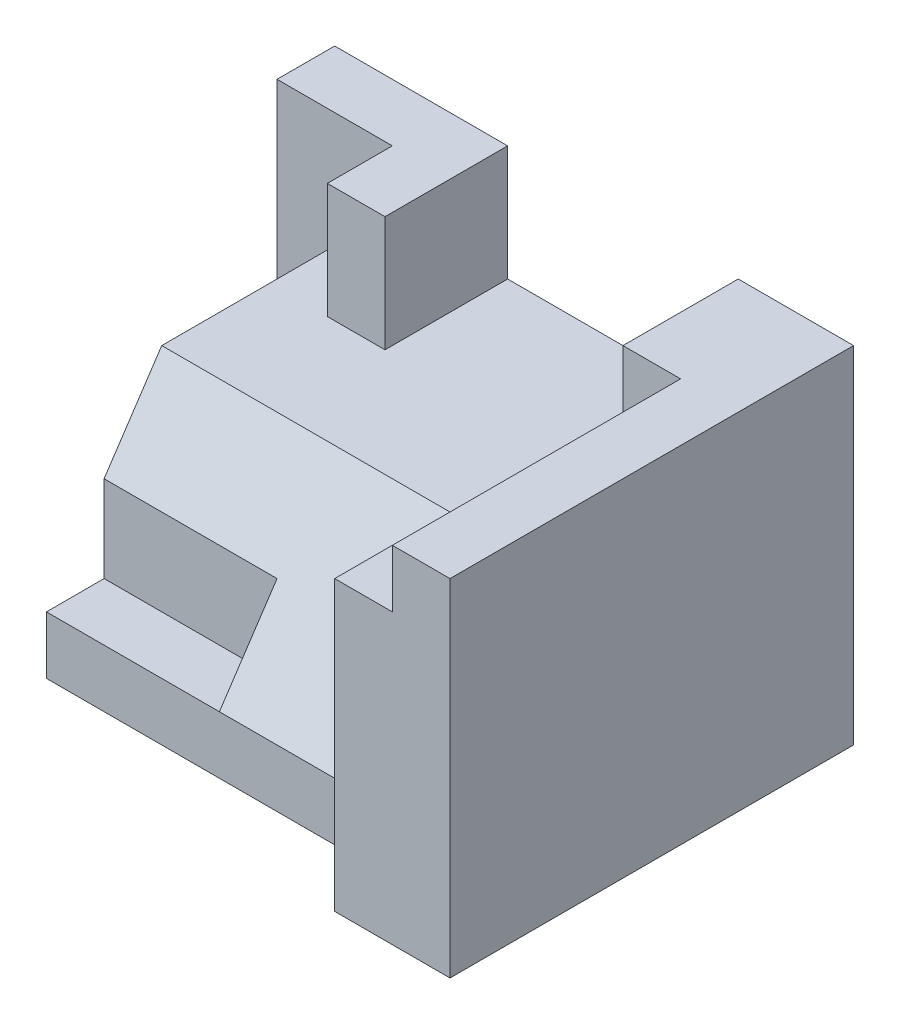
ISO-10303-21;
HEADER;
FILE_DESCRIPTION(('STEP AP214'),'2;1');
FILE_NAME('part.step','',(''),(''),'','','');
FILE_SCHEMA(('AUTOMOTIVE_DESIGN { 1 0 10303 214 1 1 1 1 }'));
ENDSEC;
DATA;
#1=APPLICATION_CONTEXT('core data for automotive mechanical design processes');
#2=APPLICATION_PROTOCOL_DEFINITION('international standard','automotive_design',2000,#1);
#3=PRODUCT_CONTEXT('',#1,'mechanical');
#4=PRODUCT('Part','Part','',(#3));
#5=PRODUCT_RELATED_PRODUCT_CATEGORY('part','',(#4));
#6=PRODUCT_DEFINITION_FORMATION('','',#4);
#7=PRODUCT_DEFINITION_CONTEXT('part definition',#1,'design');
#8=PRODUCT_DEFINITION('design','',#6,#7);
#9=PRODUCT_DEFINITION_SHAPE('','',#8);
#10=(LENGTH_UNIT() NAMED_UNIT(*) SI_UNIT(.MILLI.,.METRE.));
#11=(NAMED_UNIT(*) PLANE_ANGLE_UNIT() SI_UNIT($,.RADIAN.));
#12=(NAMED_UNIT(*) SI_UNIT($,.STERADIAN.) SOLID_ANGLE_UNIT());
#13=UNCERTAINTY_MEASURE_WITH_UNIT(LENGTH_MEASURE(1.E-05),#10,'distance_accuracy_value','');
#14=(GEOMETRIC_REPRESENTATION_CONTEXT(3) GLOBAL_UNCERTAINTY_ASSIGNED_CONTEXT((#13)) GLOBAL_UNIT_ASSIGNED_CONTEXT((#10,
#11,#12)) REPRESENTATION_CONTEXT('',''));
#15=CARTESIAN_POINT('',(0.,0.,0.));
#16=DIRECTION('',(0.,0.,1.));
#17=DIRECTION('',(1.,0.,0.));
#18=AXIS2_PLACEMENT_3D('',#15,#16,#17);
#19=CARTESIAN_POINT('',(7.,4.,-3.));
#20=DIRECTION('',(0.,-1.,0.));
#21=DIRECTION('',(0.,0.,-1.));
#22=AXIS2_PLACEMENT_3D('',#19,#20,#21);
#23=PLANE('',#22);
#24=DIRECTION('',(0.,0.,1.));
#25=VECTOR('',#24,1.);
#26=CARTESIAN_POINT('',(3.,4.,-6.));
#27=LINE('',#26,#25);
#28=CARTESIAN_POINT('',(3.,4.,-7.));
#29=VERTEX_POINT('',#28);
#30=CARTESIAN_POINT('',(3.,4.,-4.87246068942682));
#31=VERTEX_POINT('',#30);
#32=EDGE_CURVE('E48',#29,#31,#27,.T.);
#33=ORIENTED_EDGE('',*,*,#32,.T.);
#34=DIRECTION('',(1.,0.,0.));
#35=VECTOR('',#34,1.);
#36=CARTESIAN_POINT('',(3.,4.,-4.87246068942682));
#37=LINE('',#36,#35);
#38=CARTESIAN_POINT('',(2.,4.,-4.87246068942682));
#39=VERTEX_POINT('',#38);
#40=EDGE_CURVE('E52',#39,#31,#37,.T.);
#41=ORIENTED_EDGE('',*,*,#40,.F.);
#42=DIRECTION('',(0.,0.,1.));
#43=VECTOR('',#42,1.);
#44=CARTESIAN_POINT('',(2.,4.,-6.));
#45=LINE('',#44,#43);
#46=CARTESIAN_POINT('',(2.,4.,-6.));
#47=VERTEX_POINT('',#46);
#48=EDGE_CURVE('E180',#47,#39,#45,.T.);
#49=ORIENTED_EDGE('',*,*,#48,.F.);
#50=DIRECTION('',(-1.,0.,0.));
#51=VECTOR('',#50,1.);
#52=CARTESIAN_POINT('',(7.,4.,-6.));
#53=LINE('',#52,#51);
#54=CARTESIAN_POINT('',(1.,4.,-6.));
#55=VERTEX_POINT('',#54);
#56=EDGE_CURVE('E287',#47,#55,#53,.T.);
#57=ORIENTED_EDGE('',*,*,#56,.T.);
#58=DIRECTION('',(0.,0.,-1.));
#59=VECTOR('',#58,1.);
#60=CARTESIAN_POINT('',(1.,4.,-6.));
#61=LINE('',#60,#59);
#62=CARTESIAN_POINT('',(1.,4.,-3.));
#63=VERTEX_POINT('',#62);
#64=EDGE_CURVE('E252',#63,#55,#61,.T.);
#65=ORIENTED_EDGE('',*,*,#64,.F.);
#66=DIRECTION('',(-1.,0.,0.));
#67=VECTOR('',#66,1.);
#68=CARTESIAN_POINT('',(7.,4.,-3.));
#69=LINE('',#68,#67);
#70=CARTESIAN_POINT('',(7.,4.,-3.));
#71=VERTEX_POINT('',#70);
#72=EDGE_CURVE('E284',#71,#63,#69,.T.);
#73=ORIENTED_EDGE('',*,*,#72,.F.);
#74=DIRECTION('',(0.,0.,1.));
#75=VECTOR('',#74,1.);
#76=CARTESIAN_POINT('',(7.,4.,-3.));
#77=LINE('',#76,#75);
#78=CARTESIAN_POINT('',(7.,4.,-7.));
#79=VERTEX_POINT('',#78);
#80=EDGE_CURVE('E266',#79,#71,#77,.T.);
#81=ORIENTED_EDGE('',*,*,#80,.F.);
#82=DIRECTION('',(-1.,0.,0.));
#83=VECTOR('',#82,1.);
#84=CARTESIAN_POINT('',(7.,4.,-7.));
#85=LINE('',#84,#83);
#86=EDGE_CURVE('E194',#79,#29,#85,.T.);
#87=ORIENTED_EDGE('',*,*,#86,.T.);
#88=EDGE_LOOP('',(#33,#41,#49,#57,#65,#73,#81,#87));
#89=FACE_BOUND('',#88,.T.);
#90=ADVANCED_FACE('F33',(#89),#23,.F.);
#91=CARTESIAN_POINT('',(7.,4.,-6.));
#92=DIRECTION('',(0.,0.,-1.));
#93=DIRECTION('',(-1.,0.,0.));
#94=AXIS2_PLACEMENT_3D('',#91,#92,#93);
#95=PLANE('',#94);
#96=DIRECTION('',(0.,-1.,0.));
#97=VECTOR('',#96,1.);
#98=CARTESIAN_POINT('',(2.,6.,-6.));
#99=LINE('',#98,#97);
#100=CARTESIAN_POINT('',(2.,6.,-6.));
#101=VERTEX_POINT('',#100);
#102=EDGE_CURVE('E182',#101,#47,#99,.T.);
#103=ORIENTED_EDGE('',*,*,#102,.F.);
#104=DIRECTION('',(-1.,0.,0.));
#105=VECTOR('',#104,1.);
#106=CARTESIAN_POINT('',(7.,6.,-6.));
#107=LINE('',#106,#105);
#108=CARTESIAN_POINT('',(0.,6.,-6.));
#109=VERTEX_POINT('',#108);
#110=EDGE_CURVE('E173',#101,#109,#107,.T.);
#111=ORIENTED_EDGE('',*,*,#110,.T.);
#112=DIRECTION('',(0.,-1.,0.));
#113=VECTOR('',#112,1.);
#114=CARTESIAN_POINT('',(0.,4.,-6.));
#115=LINE('',#114,#113);
#116=CARTESIAN_POINT('',(0.,0.,-6.));
#117=VERTEX_POINT('',#116);
#118=EDGE_CURVE('E260',#109,#117,#115,.T.);
#119=ORIENTED_EDGE('',*,*,#118,.T.);
#120=DIRECTION('',(-1.,0.,0.));
#121=VECTOR('',#120,1.);
#122=CARTESIAN_POINT('',(1.,0.,-6.));
#123=LINE('',#122,#121);
#124=CARTESIAN_POINT('',(1.,0.,-6.));
#125=VERTEX_POINT('',#124);
#126=EDGE_CURVE('E255',#125,#117,#123,.T.);
#127=ORIENTED_EDGE('',*,*,#126,.F.);
#128=DIRECTION('',(0.,-1.,0.));
#129=VECTOR('',#128,1.);
#130=CARTESIAN_POINT('',(1.,4.,-6.));
#131=LINE('',#130,#129);
#132=EDGE_CURVE('E241',#55,#125,#131,.T.);
#133=ORIENTED_EDGE('',*,*,#132,.F.);
#134=ORIENTED_EDGE('',*,*,#56,.F.);
#135=EDGE_LOOP('',(#103,#111,#119,#127,#133,#134));
#136=FACE_BOUND('',#135,.T.);
#137=ADVANCED_FACE('F373',(#136),#95,.F.);
#138=CARTESIAN_POINT('',(0.,6.,0.));
#139=DIRECTION('',(0.,-1.,0.));
#140=DIRECTION('',(0.,0.,-1.));
#141=AXIS2_PLACEMENT_3D('',#138,#139,#140);
#142=PLANE('',#141);
#143=DIRECTION('',(-1.,0.,0.));
#144=VECTOR('',#143,1.);
#145=CARTESIAN_POINT('',(0.,6.,-7.));
#146=LINE('',#145,#144);
#147=CARTESIAN_POINT('',(9.,6.,-7.));
#148=VERTEX_POINT('',#147);
#149=CARTESIAN_POINT('',(7.,6.,-7.));
#150=VERTEX_POINT('',#149);
#151=EDGE_CURVE('E298',#148,#150,#146,.T.);
#152=ORIENTED_EDGE('',*,*,#151,.T.);
#153=DIRECTION('',(0.,0.,-1.));
#154=VECTOR('',#153,1.);
#155=CARTESIAN_POINT('',(7.,6.,-6.));
#156=LINE('',#155,#154);
#157=CARTESIAN_POINT('',(7.,6.,-5.));
#158=VERTEX_POINT('',#157);
#159=EDGE_CURVE('E264',#158,#150,#156,.T.);
#160=ORIENTED_EDGE('',*,*,#159,.F.);
#161=DIRECTION('',(-1.,0.,0.));
#162=VECTOR('',#161,1.);
#163=CARTESIAN_POINT('',(7.,6.,-5.));
#164=LINE('',#163,#162);
#165=CARTESIAN_POINT('',(8.,6.,-5.));
#166=VERTEX_POINT('',#165);
#167=EDGE_CURVE('E232',#166,#158,#164,.T.);
#168=ORIENTED_EDGE('',*,*,#167,.F.);
#169=DIRECTION('',(0.,0.,1.));
#170=VECTOR('',#169,1.);
#171=CARTESIAN_POINT('',(8.,6.,-5.));
#172=LINE('',#171,#170);
#173=CARTESIAN_POINT('',(8.,6.,0.));
#174=VERTEX_POINT('',#173);
#175=EDGE_CURVE('E238',#166,#174,#172,.T.);
#176=ORIENTED_EDGE('',*,*,#175,.T.);
#177=DIRECTION('',(1.,0.,0.));
#178=VECTOR('',#177,1.);
#179=CARTESIAN_POINT('',(0.,6.,0.));
#180=LINE('',#179,#178);
#181=CARTESIAN_POINT('',(9.,6.,0.));
#182=VERTEX_POINT('',#181);
#183=EDGE_CURVE('E292',#174,#182,#180,.T.);
#184=ORIENTED_EDGE('',*,*,#183,.T.);
#185=DIRECTION('',(0.,0.,-1.));
#186=VECTOR('',#185,1.);
#187=CARTESIAN_POINT('',(9.,6.,0.));
#188=LINE('',#187,#186);
#189=EDGE_CURVE('E295',#182,#148,#188,.T.);
#190=ORIENTED_EDGE('',*,*,#189,.T.);
#191=EDGE_LOOP('',(#152,#160,#168,#176,#184,#190));
#192=FACE_BOUND('',#191,.T.);
#193=ADVANCED_FACE('F348',(#192),#142,.F.);
#194=CARTESIAN_POINT('',(7.,0.,-1.));
#195=DIRECTION('',(0.,0.,-1.));
#196=DIRECTION('',(-1.,0.,0.));
#197=AXIS2_PLACEMENT_3D('',#194,#195,#196);
#198=PLANE('',#197);
#199=DIRECTION('',(0.,1.,0.));
#200=VECTOR('',#199,1.);
#201=CARTESIAN_POINT('',(1.,4.,-1.));
#202=LINE('',#201,#200);
#203=CARTESIAN_POINT('',(1.,0.,-1.));
#204=VERTEX_POINT('',#203);
#205=CARTESIAN_POINT('',(1.,1.,-1.));
#206=VERTEX_POINT('',#205);
#207=EDGE_CURVE('E249',#204,#206,#202,.T.);
#208=ORIENTED_EDGE('',*,*,#207,.F.);
#209=DIRECTION('',(-1.,0.,0.));
#210=VECTOR('',#209,1.);
#211=CARTESIAN_POINT('',(7.,0.,-1.));
#212=LINE('',#211,#210);
#213=CARTESIAN_POINT('',(7.,0.,-1.));
#214=VERTEX_POINT('',#213);
#215=EDGE_CURVE('E277',#214,#204,#212,.T.);
#216=ORIENTED_EDGE('',*,*,#215,.F.);
#217=DIRECTION('',(0.,-1.,0.));
#218=VECTOR('',#217,1.);
#219=CARTESIAN_POINT('',(7.,0.,-1.));
#220=LINE('',#219,#218);
#221=CARTESIAN_POINT('',(7.,1.,-1.));
#222=VERTEX_POINT('',#221);
#223=EDGE_CURVE('E272',#222,#214,#220,.T.);
#224=ORIENTED_EDGE('',*,*,#223,.F.);
#225=DIRECTION('',(-1.,0.,0.));
#226=VECTOR('',#225,1.);
#227=CARTESIAN_POINT('',(7.,1.,-1.));
#228=LINE('',#227,#226);
#229=CARTESIAN_POINT('',(4.,1.,-1.));
#230=VERTEX_POINT('',#229);
#231=EDGE_CURVE('E281',#222,#230,#228,.T.);
#232=ORIENTED_EDGE('',*,*,#231,.T.);
#233=DIRECTION('',(-1.,0.,0.));
#234=VECTOR('',#233,1.);
#235=CARTESIAN_POINT('',(4.,1.,-1.));
#236=LINE('',#235,#234);
#237=EDGE_CURVE('E215',#230,#206,#236,.T.);
#238=ORIENTED_EDGE('',*,*,#237,.T.);
#239=EDGE_LOOP('',(#208,#216,#224,#232,#238));
#240=FACE_BOUND('',#239,.T.);
#241=ADVANCED_FACE('F365',(#240),#198,.F.);
#242=CARTESIAN_POINT('',(7.,1.,-1.));
#243=DIRECTION('',(0.,-0.554700196225229,-0.832050294337844));
#244=DIRECTION('',(0.,0.832050294337844,-0.554700196225229));
#245=AXIS2_PLACEMENT_3D('',#242,#243,#244);
#246=PLANE('',#245);
#247=DIRECTION('',(0.,0.832050294337844,-0.554700196225229));
#248=VECTOR('',#247,1.);
#249=CARTESIAN_POINT('',(1.,1.,-1.));
#250=LINE('',#249,#248);
#251=CARTESIAN_POINT('',(1.,2.5,-2.));
#252=VERTEX_POINT('',#251);
#253=EDGE_CURVE('E258',#252,#63,#250,.T.);
#254=ORIENTED_EDGE('',*,*,#253,.F.);
#255=DIRECTION('',(-1.,0.,0.));
#256=VECTOR('',#255,1.);
#257=CARTESIAN_POINT('',(4.,2.5,-2.));
#258=LINE('',#257,#256);
#259=CARTESIAN_POINT('',(4.,2.5,-2.));
#260=VERTEX_POINT('',#259);
#261=EDGE_CURVE('E211',#260,#252,#258,.T.);
#262=ORIENTED_EDGE('',*,*,#261,.F.);
#263=DIRECTION('',(0.,0.832050294337844,-0.554700196225229));
#264=VECTOR('',#263,1.);
#265=CARTESIAN_POINT('',(4.,1.,-1.));
#266=LINE('',#265,#264);
#267=EDGE_CURVE('E11',#230,#260,#266,.T.);
#268=ORIENTED_EDGE('',*,*,#267,.F.);
#269=ORIENTED_EDGE('',*,*,#231,.F.);
#270=DIRECTION('',(0.,-0.832050294337844,0.554700196225229));
#271=VECTOR('',#270,1.);
#272=CARTESIAN_POINT('',(7.,1.,-1.));
#273=LINE('',#272,#271);
#274=EDGE_CURVE('E269',#71,#222,#273,.T.);
#275=ORIENTED_EDGE('',*,*,#274,.F.);
#276=ORIENTED_EDGE('',*,*,#72,.T.);
#277=EDGE_LOOP('',(#254,#262,#268,#269,#275,#276));
#278=FACE_BOUND('',#277,.T.);
#279=ADVANCED_FACE('F376',(#278),#246,.F.);
#280=CARTESIAN_POINT('',(0.,6.,0.));
#281=DIRECTION('',(1.,0.,0.));
#282=DIRECTION('',(0.,0.,-1.));
#283=AXIS2_PLACEMENT_3D('',#280,#281,#282);
#284=PLANE('',#283);
#285=DIRECTION('',(0.,0.,1.));
#286=VECTOR('',#285,1.);
#287=CARTESIAN_POINT('',(0.,0.,0.));
#288=LINE('',#287,#286);
#289=CARTESIAN_POINT('',(0.,0.,-7.));
#290=VERTEX_POINT('',#289);
#291=EDGE_CURVE('E280',#290,#117,#288,.T.);
#292=ORIENTED_EDGE('',*,*,#291,.T.);
#293=ORIENTED_EDGE('',*,*,#118,.F.);
#294=DIRECTION('',(0.,0.,1.));
#295=VECTOR('',#294,1.);
#296=CARTESIAN_POINT('',(0.,6.,0.));
#297=LINE('',#296,#295);
#298=CARTESIAN_POINT('',(0.,6.,-7.));
#299=VERTEX_POINT('',#298);
#300=EDGE_CURVE('E290',#299,#109,#297,.T.);
#301=ORIENTED_EDGE('',*,*,#300,.F.);
#302=DIRECTION('',(0.,-1.,0.));
#303=VECTOR('',#302,1.);
#304=CARTESIAN_POINT('',(0.,6.,-7.));
#305=LINE('',#304,#303);
#306=EDGE_CURVE('E301',#299,#290,#305,.T.);
#307=ORIENTED_EDGE('',*,*,#306,.T.);
#308=EDGE_LOOP('',(#292,#293,#301,#307));
#309=FACE_BOUND('',#308,.T.);
#310=ADVANCED_FACE('F35',(#309),#284,.F.);
#311=CARTESIAN_POINT('',(0.,6.,0.));
#312=DIRECTION('',(0.,0.,-1.));
#313=DIRECTION('',(-1.,0.,0.));
#314=AXIS2_PLACEMENT_3D('',#311,#312,#313);
#315=PLANE('',#314);
#316=ORIENTED_EDGE('',*,*,#183,.F.);
#317=DIRECTION('',(0.,1.,0.));
#318=VECTOR('',#317,1.);
#319=CARTESIAN_POINT('',(8.,6.,0.));
#320=LINE('',#319,#318);
#321=CARTESIAN_POINT('',(8.,5.,0.));
#322=VERTEX_POINT('',#321);
#323=EDGE_CURVE('E226',#322,#174,#320,.T.);
#324=ORIENTED_EDGE('',*,*,#323,.F.);
#325=DIRECTION('',(1.,0.,0.));
#326=VECTOR('',#325,1.);
#327=CARTESIAN_POINT('',(7.,5.,0.));
#328=LINE('',#327,#326);
#329=CARTESIAN_POINT('',(7.,5.,0.));
#330=VERTEX_POINT('',#329);
#331=EDGE_CURVE('E218',#330,#322,#328,.T.);
#332=ORIENTED_EDGE('',*,*,#331,.F.);
#333=DIRECTION('',(0.,1.,0.));
#334=VECTOR('',#333,1.);
#335=CARTESIAN_POINT('',(7.,6.,0.));
#336=LINE('',#335,#334);
#337=CARTESIAN_POINT('',(7.,0.,0.));
#338=VERTEX_POINT('',#337);
#339=EDGE_CURVE('E261',#338,#330,#336,.T.);
#340=ORIENTED_EDGE('',*,*,#339,.F.);
#341=DIRECTION('',(1.,0.,0.));
#342=VECTOR('',#341,1.);
#343=CARTESIAN_POINT('',(0.,0.,0.));
#344=LINE('',#343,#342);
#345=CARTESIAN_POINT('',(9.,0.,0.));
#346=VERTEX_POINT('',#345);
#347=EDGE_CURVE('E304',#338,#346,#344,.T.);
#348=ORIENTED_EDGE('',*,*,#347,.T.);
#349=DIRECTION('',(0.,-1.,0.));
#350=VECTOR('',#349,1.);
#351=CARTESIAN_POINT('',(9.,6.,0.));
#352=LINE('',#351,#350);
#353=EDGE_CURVE('E41',#182,#346,#352,.T.);
#354=ORIENTED_EDGE('',*,*,#353,.F.);
#355=EDGE_LOOP('',(#316,#324,#332,#340,#348,#354));
#356=FACE_BOUND('',#355,.T.);
#357=ADVANCED_FACE('F351',(#356),#315,.F.);
#358=CARTESIAN_POINT('',(9.,6.,0.));
#359=DIRECTION('',(-1.,0.,0.));
#360=DIRECTION('',(0.,0.,1.));
#361=AXIS2_PLACEMENT_3D('',#358,#359,#360);
#362=PLANE('',#361);
#363=DIRECTION('',(0.,0.,-1.));
#364=VECTOR('',#363,1.);
#365=CARTESIAN_POINT('',(9.,0.,0.));
#366=LINE('',#365,#364);
#367=CARTESIAN_POINT('',(9.,0.,-7.));
#368=VERTEX_POINT('',#367);
#369=EDGE_CURVE('E306',#346,#368,#366,.T.);
#370=ORIENTED_EDGE('',*,*,#369,.T.);
#371=DIRECTION('',(0.,-1.,0.));
#372=VECTOR('',#371,1.);
#373=CARTESIAN_POINT('',(9.,6.,-7.));
#374=LINE('',#373,#372);
#375=EDGE_CURVE('E311',#148,#368,#374,.T.);
#376=ORIENTED_EDGE('',*,*,#375,.F.);
#377=ORIENTED_EDGE('',*,*,#189,.F.);
#378=ORIENTED_EDGE('',*,*,#353,.T.);
#379=EDGE_LOOP('',(#370,#376,#377,#378));
#380=FACE_BOUND('',#379,.T.);
#381=ADVANCED_FACE('F318',(#380),#362,.F.);
#382=CARTESIAN_POINT('',(0.,6.,-7.));
#383=DIRECTION('',(0.,0.,1.));
#384=DIRECTION('',(1.,0.,0.));
#385=AXIS2_PLACEMENT_3D('',#382,#383,#384);
#386=PLANE('',#385);
#387=ORIENTED_EDGE('',*,*,#86,.F.);
#388=DIRECTION('',(0.,1.,0.));
#389=VECTOR('',#388,1.);
#390=CARTESIAN_POINT('',(7.,4.,-7.));
#391=LINE('',#390,#389);
#392=EDGE_CURVE('E197',#79,#150,#391,.T.);
#393=ORIENTED_EDGE('',*,*,#392,.T.);
#394=ORIENTED_EDGE('',*,*,#151,.F.);
#395=ORIENTED_EDGE('',*,*,#375,.T.);
#396=DIRECTION('',(-1.,0.,0.));
#397=VECTOR('',#396,1.);
#398=CARTESIAN_POINT('',(0.,0.,-7.));
#399=LINE('',#398,#397);
#400=EDGE_CURVE('E293',#368,#290,#399,.T.);
#401=ORIENTED_EDGE('',*,*,#400,.T.);
#402=ORIENTED_EDGE('',*,*,#306,.F.);
#403=CARTESIAN_POINT('',(3.,6.,-7.));
#404=VERTEX_POINT('',#403);
#405=EDGE_CURVE('E297',#404,#299,#146,.T.);
#406=ORIENTED_EDGE('',*,*,#405,.F.);
#407=DIRECTION('',(0.,1.,0.));
#408=VECTOR('',#407,1.);
#409=CARTESIAN_POINT('',(3.,4.,-7.));
#410=LINE('',#409,#408);
#411=EDGE_CURVE('E199',#29,#404,#410,.T.);
#412=ORIENTED_EDGE('',*,*,#411,.F.);
#413=EDGE_LOOP('',(#387,#393,#394,#395,#401,#402,#406,#412));
#414=FACE_BOUND('',#413,.T.);
#415=ADVANCED_FACE('F331',(#414),#386,.F.);
#416=ORIENTED_EDGE('',*,*,#110,.F.);
#417=DIRECTION('',(0.,0.,1.));
#418=VECTOR('',#417,1.);
#419=CARTESIAN_POINT('',(2.,6.,-6.));
#420=LINE('',#419,#418);
#421=CARTESIAN_POINT('',(2.,6.,-4.87246068942682));
#422=VERTEX_POINT('',#421);
#423=EDGE_CURVE('E165',#101,#422,#420,.T.);
#424=ORIENTED_EDGE('',*,*,#423,.T.);
#425=DIRECTION('',(1.,0.,0.));
#426=VECTOR('',#425,1.);
#427=CARTESIAN_POINT('',(3.,6.,-4.87246068942682));
#428=LINE('',#427,#426);
#429=CARTESIAN_POINT('',(3.,6.,-4.87246068942682));
#430=VERTEX_POINT('',#429);
#431=EDGE_CURVE('E170',#422,#430,#428,.T.);
#432=ORIENTED_EDGE('',*,*,#431,.T.);
#433=DIRECTION('',(0.,0.,1.));
#434=VECTOR('',#433,1.);
#435=CARTESIAN_POINT('',(3.,6.,-6.));
#436=LINE('',#435,#434);
#437=EDGE_CURVE('E193',#404,#430,#436,.T.);
#438=ORIENTED_EDGE('',*,*,#437,.F.);
#439=ORIENTED_EDGE('',*,*,#405,.T.);
#440=ORIENTED_EDGE('',*,*,#300,.T.);
#441=EDGE_LOOP('',(#416,#424,#432,#438,#439,#440));
#442=FACE_BOUND('',#441,.T.);
#443=ADVANCED_FACE('F167',(#442),#142,.F.);
#444=CARTESIAN_POINT('',(0.,0.,0.));
#445=DIRECTION('',(0.,-1.,0.));
#446=DIRECTION('',(0.,0.,-1.));
#447=AXIS2_PLACEMENT_3D('',#444,#445,#446);
#448=PLANE('',#447);
#449=ORIENTED_EDGE('',*,*,#126,.T.);
#450=ORIENTED_EDGE('',*,*,#291,.F.);
#451=ORIENTED_EDGE('',*,*,#400,.F.);
#452=ORIENTED_EDGE('',*,*,#369,.F.);
#453=ORIENTED_EDGE('',*,*,#347,.F.);
#454=DIRECTION('',(0.,0.,1.));
#455=VECTOR('',#454,1.);
#456=CARTESIAN_POINT('',(7.,0.,0.));
#457=LINE('',#456,#455);
#458=EDGE_CURVE('E274',#214,#338,#457,.T.);
#459=ORIENTED_EDGE('',*,*,#458,.F.);
#460=ORIENTED_EDGE('',*,*,#215,.T.);
#461=DIRECTION('',(0.,0.,1.));
#462=VECTOR('',#461,1.);
#463=CARTESIAN_POINT('',(1.,0.,-6.));
#464=LINE('',#463,#462);
#465=EDGE_CURVE('E247',#125,#204,#464,.T.);
#466=ORIENTED_EDGE('',*,*,#465,.F.);
#467=EDGE_LOOP('',(#449,#450,#451,#452,#453,#459,#460,#466));
#468=FACE_BOUND('',#467,.T.);
#469=ADVANCED_FACE('F325',(#468),#448,.T.);
#470=CARTESIAN_POINT('',(7.,0.,0.));
#471=DIRECTION('',(1.,0.,0.));
#472=DIRECTION('',(0.,0.,-1.));
#473=AXIS2_PLACEMENT_3D('',#470,#471,#472);
#474=PLANE('',#473);
#475=ORIENTED_EDGE('',*,*,#339,.T.);
#476=DIRECTION('',(0.,0.,1.));
#477=VECTOR('',#476,1.);
#478=CARTESIAN_POINT('',(7.,5.,-5.));
#479=LINE('',#478,#477);
#480=CARTESIAN_POINT('',(7.,5.,-5.));
#481=VERTEX_POINT('',#480);
#482=EDGE_CURVE('E234',#481,#330,#479,.T.);
#483=ORIENTED_EDGE('',*,*,#482,.F.);
#484=DIRECTION('',(0.,-1.,0.));
#485=VECTOR('',#484,1.);
#486=CARTESIAN_POINT('',(7.,6.,-5.));
#487=LINE('',#486,#485);
#488=EDGE_CURVE('E222',#158,#481,#487,.T.);
#489=ORIENTED_EDGE('',*,*,#488,.F.);
#490=ORIENTED_EDGE('',*,*,#159,.T.);
#491=ORIENTED_EDGE('',*,*,#392,.F.);
#492=ORIENTED_EDGE('',*,*,#80,.T.);
#493=ORIENTED_EDGE('',*,*,#274,.T.);
#494=ORIENTED_EDGE('',*,*,#223,.T.);
#495=ORIENTED_EDGE('',*,*,#458,.T.);
#496=EDGE_LOOP('',(#475,#483,#489,#490,#491,#492,#493,#494,#495));
#497=FACE_BOUND('',#496,.T.);
#498=ADVANCED_FACE('F344',(#497),#474,.F.);
#499=CARTESIAN_POINT('',(1.,0.,0.));
#500=DIRECTION('',(-1.,0.,0.));
#501=DIRECTION('',(0.,0.,1.));
#502=AXIS2_PLACEMENT_3D('',#499,#500,#501);
#503=PLANE('',#502);
#504=DIRECTION('',(0.,0.,1.));
#505=VECTOR('',#504,1.);
#506=CARTESIAN_POINT('',(1.,1.,-1.));
#507=LINE('',#506,#505);
#508=CARTESIAN_POINT('',(1.,1.,-2.));
#509=VERTEX_POINT('',#508);
#510=EDGE_CURVE('E208',#509,#206,#507,.T.);
#511=ORIENTED_EDGE('',*,*,#510,.F.);
#512=DIRECTION('',(0.,-1.,0.));
#513=VECTOR('',#512,1.);
#514=CARTESIAN_POINT('',(1.,1.,-2.));
#515=LINE('',#514,#513);
#516=EDGE_CURVE('E201',#252,#509,#515,.T.);
#517=ORIENTED_EDGE('',*,*,#516,.F.);
#518=ORIENTED_EDGE('',*,*,#253,.T.);
#519=ORIENTED_EDGE('',*,*,#64,.T.);
#520=ORIENTED_EDGE('',*,*,#132,.T.);
#521=ORIENTED_EDGE('',*,*,#465,.T.);
#522=ORIENTED_EDGE('',*,*,#207,.T.);
#523=EDGE_LOOP('',(#511,#517,#518,#519,#520,#521,#522));
#524=FACE_BOUND('',#523,.T.);
#525=ADVANCED_FACE('F368',(#524),#503,.T.);
#526=CARTESIAN_POINT('',(8.,6.,-5.));
#527=DIRECTION('',(1.,0.,0.));
#528=DIRECTION('',(0.,0.,-1.));
#529=AXIS2_PLACEMENT_3D('',#526,#527,#528);
#530=PLANE('',#529);
#531=ORIENTED_EDGE('',*,*,#323,.T.);
#532=ORIENTED_EDGE('',*,*,#175,.F.);
#533=DIRECTION('',(0.,1.,0.));
#534=VECTOR('',#533,1.);
#535=CARTESIAN_POINT('',(8.,6.,-5.));
#536=LINE('',#535,#534);
#537=CARTESIAN_POINT('',(8.,5.,-5.));
#538=VERTEX_POINT('',#537);
#539=EDGE_CURVE('E229',#538,#166,#536,.T.);
#540=ORIENTED_EDGE('',*,*,#539,.F.);
#541=DIRECTION('',(0.,0.,1.));
#542=VECTOR('',#541,1.);
#543=CARTESIAN_POINT('',(8.,5.,-5.));
#544=LINE('',#543,#542);
#545=EDGE_CURVE('E242',#538,#322,#544,.T.);
#546=ORIENTED_EDGE('',*,*,#545,.T.);
#547=EDGE_LOOP('',(#531,#532,#540,#546));
#548=FACE_BOUND('',#547,.T.);
#549=ADVANCED_FACE('F355',(#548),#530,.F.);
#550=CARTESIAN_POINT('',(7.,5.,-5.));
#551=DIRECTION('',(0.,-1.,0.));
#552=DIRECTION('',(0.,0.,-1.));
#553=AXIS2_PLACEMENT_3D('',#550,#551,#552);
#554=PLANE('',#553);
#555=ORIENTED_EDGE('',*,*,#331,.T.);
#556=ORIENTED_EDGE('',*,*,#545,.F.);
#557=DIRECTION('',(1.,0.,0.));
#558=VECTOR('',#557,1.);
#559=CARTESIAN_POINT('',(7.,5.,-5.));
#560=LINE('',#559,#558);
#561=EDGE_CURVE('E225',#481,#538,#560,.T.);
#562=ORIENTED_EDGE('',*,*,#561,.F.);
#563=ORIENTED_EDGE('',*,*,#482,.T.);
#564=EDGE_LOOP('',(#555,#556,#562,#563));
#565=FACE_BOUND('',#564,.T.);
#566=ADVANCED_FACE('F358',(#565),#554,.F.);
#567=CARTESIAN_POINT('',(0.,0.,-5.));
#568=DIRECTION('',(0.,0.,1.));
#569=DIRECTION('',(1.,0.,0.));
#570=AXIS2_PLACEMENT_3D('',#567,#568,#569);
#571=PLANE('',#570);
#572=ORIENTED_EDGE('',*,*,#488,.T.);
#573=ORIENTED_EDGE('',*,*,#561,.T.);
#574=ORIENTED_EDGE('',*,*,#539,.T.);
#575=ORIENTED_EDGE('',*,*,#167,.T.);
#576=EDGE_LOOP('',(#572,#573,#574,#575));
#577=FACE_BOUND('',#576,.T.);
#578=ADVANCED_FACE('F394',(#577),#571,.T.);
#579=CARTESIAN_POINT('',(4.,0.,0.));
#580=DIRECTION('',(-1.,0.,0.));
#581=DIRECTION('',(0.,0.,1.));
#582=AXIS2_PLACEMENT_3D('',#579,#580,#581);
#583=PLANE('',#582);
#584=ORIENTED_EDGE('',*,*,#267,.T.);
#585=DIRECTION('',(0.,-1.,0.));
#586=VECTOR('',#585,1.);
#587=CARTESIAN_POINT('',(4.,1.,-2.));
#588=LINE('',#587,#586);
#589=CARTESIAN_POINT('',(4.,1.,-2.));
#590=VERTEX_POINT('',#589);
#591=EDGE_CURVE('E204',#260,#590,#588,.T.);
#592=ORIENTED_EDGE('',*,*,#591,.T.);
#593=DIRECTION('',(0.,0.,1.));
#594=VECTOR('',#593,1.);
#595=CARTESIAN_POINT('',(4.,1.,-1.));
#596=LINE('',#595,#594);
#597=EDGE_CURVE('E207',#590,#230,#596,.T.);
#598=ORIENTED_EDGE('',*,*,#597,.T.);
#599=EDGE_LOOP('',(#584,#592,#598));
#600=FACE_BOUND('',#599,.T.);
#601=ADVANCED_FACE('F381',(#600),#583,.T.);
#602=CARTESIAN_POINT('',(4.,1.,-1.));
#603=DIRECTION('',(0.,-1.,0.));
#604=DIRECTION('',(0.,0.,-1.));
#605=AXIS2_PLACEMENT_3D('',#602,#603,#604);
#606=PLANE('',#605);
#607=ORIENTED_EDGE('',*,*,#510,.T.);
#608=ORIENTED_EDGE('',*,*,#237,.F.);
#609=ORIENTED_EDGE('',*,*,#597,.F.);
#610=DIRECTION('',(-1.,0.,0.));
#611=VECTOR('',#610,1.);
#612=CARTESIAN_POINT('',(4.,1.,-2.));
#613=LINE('',#612,#611);
#614=EDGE_CURVE('E219',#590,#509,#613,.T.);
#615=ORIENTED_EDGE('',*,*,#614,.T.);
#616=EDGE_LOOP('',(#607,#608,#609,#615));
#617=FACE_BOUND('',#616,.T.);
#618=ADVANCED_FACE('F386',(#617),#606,.F.);
#619=CARTESIAN_POINT('',(4.,1.,-2.));
#620=DIRECTION('',(0.,0.,-1.));
#621=DIRECTION('',(-1.,0.,0.));
#622=AXIS2_PLACEMENT_3D('',#619,#620,#621);
#623=PLANE('',#622);
#624=ORIENTED_EDGE('',*,*,#516,.T.);
#625=ORIENTED_EDGE('',*,*,#614,.F.);
#626=ORIENTED_EDGE('',*,*,#591,.F.);
#627=ORIENTED_EDGE('',*,*,#261,.T.);
#628=EDGE_LOOP('',(#624,#625,#626,#627));
#629=FACE_BOUND('',#628,.T.);
#630=ADVANCED_FACE('F384',(#629),#623,.F.);
#631=CARTESIAN_POINT('',(3.,4.,-6.));
#632=DIRECTION('',(-1.,0.,0.));
#633=DIRECTION('',(0.,0.,1.));
#634=AXIS2_PLACEMENT_3D('',#631,#632,#633);
#635=PLANE('',#634);
#636=ORIENTED_EDGE('',*,*,#437,.T.);
#637=DIRECTION('',(0.,-1.,0.));
#638=VECTOR('',#637,1.);
#639=CARTESIAN_POINT('',(3.,6.,-4.87246068942682));
#640=LINE('',#639,#638);
#641=EDGE_CURVE('E183',#430,#31,#640,.T.);
#642=ORIENTED_EDGE('',*,*,#641,.T.);
#643=ORIENTED_EDGE('',*,*,#32,.F.);
#644=ORIENTED_EDGE('',*,*,#411,.T.);
#645=EDGE_LOOP('',(#636,#642,#643,#644));
#646=FACE_BOUND('',#645,.T.);
#647=ADVANCED_FACE('F339',(#646),#635,.F.);
#648=CARTESIAN_POINT('',(2.,6.,-6.));
#649=DIRECTION('',(1.,0.,0.));
#650=DIRECTION('',(0.,0.,-1.));
#651=AXIS2_PLACEMENT_3D('',#648,#649,#650);
#652=PLANE('',#651);
#653=ORIENTED_EDGE('',*,*,#48,.T.);
#654=DIRECTION('',(0.,-1.,0.));
#655=VECTOR('',#654,1.);
#656=CARTESIAN_POINT('',(2.,6.,-4.87246068942682));
#657=LINE('',#656,#655);
#658=EDGE_CURVE('E178',#422,#39,#657,.T.);
#659=ORIENTED_EDGE('',*,*,#658,.F.);
#660=ORIENTED_EDGE('',*,*,#423,.F.);
#661=ORIENTED_EDGE('',*,*,#102,.T.);
#662=EDGE_LOOP('',(#653,#659,#660,#661));
#663=FACE_BOUND('',#662,.T.);
#664=ADVANCED_FACE('F179',(#663),#652,.F.);
#665=CARTESIAN_POINT('',(3.,6.,-4.87246068942682));
#666=DIRECTION('',(0.,0.,-1.));
#667=DIRECTION('',(0.,1.,0.));
#668=AXIS2_PLACEMENT_3D('',#665,#666,#667);
#669=PLANE('',#668);
#670=ORIENTED_EDGE('',*,*,#40,.T.);
#671=ORIENTED_EDGE('',*,*,#641,.F.);
#672=ORIENTED_EDGE('',*,*,#431,.F.);
#673=ORIENTED_EDGE('',*,*,#658,.T.);
#674=EDGE_LOOP('',(#670,#671,#672,#673));
#675=FACE_BOUND('',#674,.T.);
#676=ADVANCED_FACE('F185',(#675),#669,.F.);
#677=CLOSED_SHELL('',(#90,#137,#193,#241,#279,#310,#357,#381,#415,#443,#469,#498,#525,#549,#566,
#578,#601,#618,#630,#647,#664,#676));
#678=MANIFOLD_SOLID_BREP('B2',#677);
#679=ADVANCED_BREP_SHAPE_REPRESENTATION('',(#18,#678),#14);
#680=SHAPE_DEFINITION_REPRESENTATION(#9,#679);
ENDSEC;
END-ISO-10303-21;
